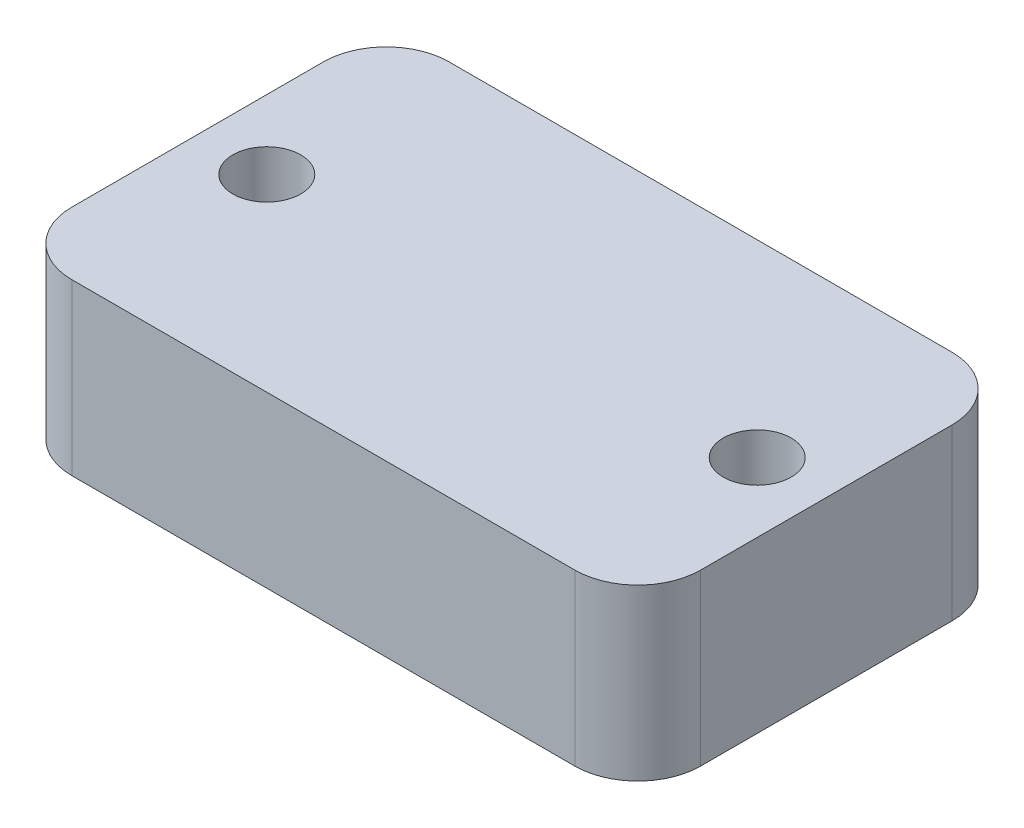
ISO-10303-21;
HEADER;
FILE_DESCRIPTION(('STEP AP214'),'2;1');
FILE_NAME('part.step','',(''),(''),'','','');
FILE_SCHEMA(('AUTOMOTIVE_DESIGN { 1 0 10303 214 1 1 1 1 }'));
ENDSEC;
DATA;
#1=APPLICATION_CONTEXT('core data for automotive mechanical design processes');
#2=APPLICATION_PROTOCOL_DEFINITION('international standard','automotive_design',2000,#1);
#3=PRODUCT_CONTEXT('',#1,'mechanical');
#4=PRODUCT('Part','Part','',(#3));
#5=PRODUCT_RELATED_PRODUCT_CATEGORY('part','',(#4));
#6=PRODUCT_DEFINITION_FORMATION('','',#4);
#7=PRODUCT_DEFINITION_CONTEXT('part definition',#1,'design');
#8=PRODUCT_DEFINITION('design','',#6,#7);
#9=PRODUCT_DEFINITION_SHAPE('','',#8);
#10=(LENGTH_UNIT() NAMED_UNIT(*) SI_UNIT(.MILLI.,.METRE.));
#11=(NAMED_UNIT(*) PLANE_ANGLE_UNIT() SI_UNIT($,.RADIAN.));
#12=(NAMED_UNIT(*) SI_UNIT($,.STERADIAN.) SOLID_ANGLE_UNIT());
#13=UNCERTAINTY_MEASURE_WITH_UNIT(LENGTH_MEASURE(1.E-05),#10,'distance_accuracy_value','');
#14=(GEOMETRIC_REPRESENTATION_CONTEXT(3) GLOBAL_UNCERTAINTY_ASSIGNED_CONTEXT((#13)) GLOBAL_UNIT_ASSIGNED_CONTEXT((#10,
#11,#12)) REPRESENTATION_CONTEXT('',''));
#15=CARTESIAN_POINT('',(0.,0.,0.));
#16=DIRECTION('',(0.,0.,1.));
#17=DIRECTION('',(1.,0.,0.));
#18=AXIS2_PLACEMENT_3D('',#15,#16,#17);
#19=CARTESIAN_POINT('',(20.,13.5,10.));
#20=DIRECTION('',(0.,1.,0.));
#21=DIRECTION('',(0.,0.,1.));
#22=AXIS2_PLACEMENT_3D('',#19,#20,#21);
#23=PLANE('',#22);
#24=CARTESIAN_POINT('',(-19.5,13.5,0.));
#25=DIRECTION('',(0.,1.,0.));
#26=DIRECTION('',(0.,0.,1.));
#27=AXIS2_PLACEMENT_3D('',#24,#25,#26);
#28=CIRCLE('',#27,2.7);
#29=CARTESIAN_POINT('',(-19.5,13.5,2.7));
#30=VERTEX_POINT('',#29);
#31=EDGE_CURVE('E134',#30,#30,#28,.T.);
#32=ORIENTED_EDGE('',*,*,#31,.F.);
#33=EDGE_LOOP('',(#32));
#34=FACE_BOUND('',#33,.T.);
#35=CARTESIAN_POINT('',(20.,13.5,10.));
#36=DIRECTION('',(0.,1.,0.));
#37=DIRECTION('',(0.,0.,1.));
#38=AXIS2_PLACEMENT_3D('',#35,#36,#37);
#39=CIRCLE('',#38,5.);
#40=CARTESIAN_POINT('',(20.,13.5,15.));
#41=VERTEX_POINT('',#40);
#42=CARTESIAN_POINT('',(25.,13.5,9.99999999999996));
#43=VERTEX_POINT('',#42);
#44=EDGE_CURVE('E145',#41,#43,#39,.T.);
#45=ORIENTED_EDGE('',*,*,#44,.T.);
#46=DIRECTION('',(0.,0.,-1.));
#47=VECTOR('',#46,1.);
#48=CARTESIAN_POINT('',(25.,13.5,9.99999999999996));
#49=LINE('',#48,#47);
#50=CARTESIAN_POINT('',(25.,13.5,-9.99999999999997));
#51=VERTEX_POINT('',#50);
#52=EDGE_CURVE('E93',#43,#51,#49,.T.);
#53=ORIENTED_EDGE('',*,*,#52,.T.);
#54=CARTESIAN_POINT('',(20.,13.5,-10.));
#55=DIRECTION('',(0.,1.,0.));
#56=DIRECTION('',(0.,0.,1.));
#57=AXIS2_PLACEMENT_3D('',#54,#55,#56);
#58=CIRCLE('',#57,5.);
#59=CARTESIAN_POINT('',(20.,13.5,-15.));
#60=VERTEX_POINT('',#59);
#61=EDGE_CURVE('E160',#51,#60,#58,.T.);
#62=ORIENTED_EDGE('',*,*,#61,.T.);
#63=DIRECTION('',(-1.,0.,0.));
#64=VECTOR('',#63,1.);
#65=CARTESIAN_POINT('',(20.,13.5,-15.));
#66=LINE('',#65,#64);
#67=CARTESIAN_POINT('',(-20.,13.5,-15.));
#68=VERTEX_POINT('',#67);
#69=EDGE_CURVE('E173',#60,#68,#66,.T.);
#70=ORIENTED_EDGE('',*,*,#69,.T.);
#71=CARTESIAN_POINT('',(-20.,13.5,-9.99999999999999));
#72=DIRECTION('',(0.,1.,0.));
#73=DIRECTION('',(0.,0.,1.));
#74=AXIS2_PLACEMENT_3D('',#71,#72,#73);
#75=CIRCLE('',#74,5.);
#76=CARTESIAN_POINT('',(-25.,13.5,-9.99999999999996));
#77=VERTEX_POINT('',#76);
#78=EDGE_CURVE('E112',#68,#77,#75,.T.);
#79=ORIENTED_EDGE('',*,*,#78,.T.);
#80=DIRECTION('',(0.,0.,1.));
#81=VECTOR('',#80,1.);
#82=CARTESIAN_POINT('',(-25.,13.5,9.99999999999997));
#83=LINE('',#82,#81);
#84=CARTESIAN_POINT('',(-25.,13.5,9.99999999999997));
#85=VERTEX_POINT('',#84);
#86=EDGE_CURVE('E106',#77,#85,#83,.T.);
#87=ORIENTED_EDGE('',*,*,#86,.T.);
#88=CARTESIAN_POINT('',(-20.,13.5,10.));
#89=DIRECTION('',(0.,1.,0.));
#90=DIRECTION('',(0.,0.,-1.));
#91=AXIS2_PLACEMENT_3D('',#88,#89,#90);
#92=CIRCLE('',#91,5.);
#93=CARTESIAN_POINT('',(-20.,13.5,15.));
#94=VERTEX_POINT('',#93);
#95=EDGE_CURVE('E110',#85,#94,#92,.T.);
#96=ORIENTED_EDGE('',*,*,#95,.T.);
#97=DIRECTION('',(1.,0.,0.));
#98=VECTOR('',#97,1.);
#99=CARTESIAN_POINT('',(20.,13.5,15.));
#100=LINE('',#99,#98);
#101=EDGE_CURVE('E50',#94,#41,#100,.T.);
#102=ORIENTED_EDGE('',*,*,#101,.T.);
#103=EDGE_LOOP('',(#45,#53,#62,#70,#79,#87,#96,#102));
#104=FACE_BOUND('',#103,.T.);
#105=CARTESIAN_POINT('',(19.5,13.5,0.));
#106=DIRECTION('',(0.,1.,0.));
#107=DIRECTION('',(0.,0.,-1.));
#108=AXIS2_PLACEMENT_3D('',#105,#106,#107);
#109=CIRCLE('',#108,2.7);
#110=CARTESIAN_POINT('',(19.5,13.5,-2.7));
#111=VERTEX_POINT('',#110);
#112=EDGE_CURVE('E182',#111,#111,#109,.T.);
#113=ORIENTED_EDGE('',*,*,#112,.F.);
#114=EDGE_LOOP('',(#113));
#115=FACE_BOUND('',#114,.T.);
#116=ADVANCED_FACE('F33',(#34,#104,#115),#23,.T.);
#117=CARTESIAN_POINT('',(20.,0.,10.));
#118=DIRECTION('',(0.,1.,0.));
#119=DIRECTION('',(0.,0.,1.));
#120=AXIS2_PLACEMENT_3D('',#117,#118,#119);
#121=PLANE('',#120);
#122=CARTESIAN_POINT('',(20.,0.,10.));
#123=DIRECTION('',(0.,1.,0.));
#124=DIRECTION('',(0.,0.,1.));
#125=AXIS2_PLACEMENT_3D('',#122,#123,#124);
#126=CIRCLE('',#125,5.);
#127=CARTESIAN_POINT('',(20.,0.,15.));
#128=VERTEX_POINT('',#127);
#129=CARTESIAN_POINT('',(25.,0.,9.99999999999996));
#130=VERTEX_POINT('',#129);
#131=EDGE_CURVE('E130',#128,#130,#126,.T.);
#132=ORIENTED_EDGE('',*,*,#131,.F.);
#133=DIRECTION('',(1.,0.,0.));
#134=VECTOR('',#133,1.);
#135=CARTESIAN_POINT('',(20.,0.,15.));
#136=LINE('',#135,#134);
#137=CARTESIAN_POINT('',(-20.,0.,15.));
#138=VERTEX_POINT('',#137);
#139=EDGE_CURVE('E85',#138,#128,#136,.T.);
#140=ORIENTED_EDGE('',*,*,#139,.F.);
#141=CARTESIAN_POINT('',(-20.,0.,10.));
#142=DIRECTION('',(0.,1.,0.));
#143=DIRECTION('',(0.,0.,-1.));
#144=AXIS2_PLACEMENT_3D('',#141,#142,#143);
#145=CIRCLE('',#144,5.);
#146=CARTESIAN_POINT('',(-25.,0.,9.99999999999997));
#147=VERTEX_POINT('',#146);
#148=EDGE_CURVE('E79',#147,#138,#145,.T.);
#149=ORIENTED_EDGE('',*,*,#148,.F.);
#150=DIRECTION('',(0.,0.,1.));
#151=VECTOR('',#150,1.);
#152=CARTESIAN_POINT('',(-25.,0.,9.99999999999997));
#153=LINE('',#152,#151);
#154=CARTESIAN_POINT('',(-25.,0.,-9.99999999999996));
#155=VERTEX_POINT('',#154);
#156=EDGE_CURVE('E120',#155,#147,#153,.T.);
#157=ORIENTED_EDGE('',*,*,#156,.F.);
#158=CARTESIAN_POINT('',(-20.,0.,-9.99999999999999));
#159=DIRECTION('',(0.,1.,0.));
#160=DIRECTION('',(0.,0.,1.));
#161=AXIS2_PLACEMENT_3D('',#158,#159,#160);
#162=CIRCLE('',#161,5.);
#163=CARTESIAN_POINT('',(-20.,0.,-15.));
#164=VERTEX_POINT('',#163);
#165=EDGE_CURVE('E140',#164,#155,#162,.T.);
#166=ORIENTED_EDGE('',*,*,#165,.F.);
#167=DIRECTION('',(-1.,0.,0.));
#168=VECTOR('',#167,1.);
#169=CARTESIAN_POINT('',(20.,0.,-15.));
#170=LINE('',#169,#168);
#171=CARTESIAN_POINT('',(20.,0.,-15.));
#172=VERTEX_POINT('',#171);
#173=EDGE_CURVE('E138',#172,#164,#170,.T.);
#174=ORIENTED_EDGE('',*,*,#173,.F.);
#175=CARTESIAN_POINT('',(20.,0.,-10.));
#176=DIRECTION('',(0.,1.,0.));
#177=DIRECTION('',(0.,0.,1.));
#178=AXIS2_PLACEMENT_3D('',#175,#176,#177);
#179=CIRCLE('',#178,5.);
#180=CARTESIAN_POINT('',(25.,0.,-9.99999999999997));
#181=VERTEX_POINT('',#180);
#182=EDGE_CURVE('E136',#181,#172,#179,.T.);
#183=ORIENTED_EDGE('',*,*,#182,.F.);
#184=DIRECTION('',(0.,0.,-1.));
#185=VECTOR('',#184,1.);
#186=CARTESIAN_POINT('',(25.,0.,9.99999999999996));
#187=LINE('',#186,#185);
#188=EDGE_CURVE('E133',#130,#181,#187,.T.);
#189=ORIENTED_EDGE('',*,*,#188,.F.);
#190=EDGE_LOOP('',(#132,#140,#149,#157,#166,#174,#183,#189));
#191=FACE_BOUND('',#190,.T.);
#192=CARTESIAN_POINT('',(-19.5,0.,0.));
#193=DIRECTION('',(0.,1.,0.));
#194=DIRECTION('',(0.,0.,1.));
#195=AXIS2_PLACEMENT_3D('',#192,#193,#194);
#196=CIRCLE('',#195,2.7);
#197=CARTESIAN_POINT('',(-19.5,0.,2.7));
#198=VERTEX_POINT('',#197);
#199=EDGE_CURVE('E179',#198,#198,#196,.T.);
#200=ORIENTED_EDGE('',*,*,#199,.T.);
#201=EDGE_LOOP('',(#200));
#202=FACE_BOUND('',#201,.T.);
#203=CARTESIAN_POINT('',(19.5,0.,0.));
#204=DIRECTION('',(0.,1.,0.));
#205=DIRECTION('',(0.,0.,-1.));
#206=AXIS2_PLACEMENT_3D('',#203,#204,#205);
#207=CIRCLE('',#206,2.7);
#208=CARTESIAN_POINT('',(19.5,0.,-2.7));
#209=VERTEX_POINT('',#208);
#210=EDGE_CURVE('E185',#209,#209,#207,.T.);
#211=ORIENTED_EDGE('',*,*,#210,.T.);
#212=EDGE_LOOP('',(#211));
#213=FACE_BOUND('',#212,.T.);
#214=ADVANCED_FACE('F164',(#191,#202,#213),#121,.F.);
#215=CARTESIAN_POINT('',(20.,13.5,10.));
#216=DIRECTION('',(0.,-1.,0.));
#217=DIRECTION('',(0.,0.,-1.));
#218=AXIS2_PLACEMENT_3D('',#215,#216,#217);
#219=CYLINDRICAL_SURFACE('',#218,5.);
#220=ORIENTED_EDGE('',*,*,#131,.T.);
#221=DIRECTION('',(0.,-1.,0.));
#222=VECTOR('',#221,1.);
#223=CARTESIAN_POINT('',(25.,13.5,9.99999999999996));
#224=LINE('',#223,#222);
#225=EDGE_CURVE('E11',#43,#130,#224,.T.);
#226=ORIENTED_EDGE('',*,*,#225,.F.);
#227=ORIENTED_EDGE('',*,*,#44,.F.);
#228=DIRECTION('',(0.,-1.,0.));
#229=VECTOR('',#228,1.);
#230=CARTESIAN_POINT('',(20.,13.5,15.));
#231=LINE('',#230,#229);
#232=EDGE_CURVE('E126',#41,#128,#231,.T.);
#233=ORIENTED_EDGE('',*,*,#232,.T.);
#234=EDGE_LOOP('',(#220,#226,#227,#233));
#235=FACE_BOUND('',#234,.T.);
#236=ADVANCED_FACE('F35',(#235),#219,.T.);
#237=CARTESIAN_POINT('',(25.,13.5,9.99999999999996));
#238=DIRECTION('',(-1.,0.,0.));
#239=DIRECTION('',(0.,0.,1.));
#240=AXIS2_PLACEMENT_3D('',#237,#238,#239);
#241=PLANE('',#240);
#242=ORIENTED_EDGE('',*,*,#188,.T.);
#243=DIRECTION('',(0.,-1.,0.));
#244=VECTOR('',#243,1.);
#245=CARTESIAN_POINT('',(25.,13.5,-9.99999999999997));
#246=LINE('',#245,#244);
#247=EDGE_CURVE('E42',#51,#181,#246,.T.);
#248=ORIENTED_EDGE('',*,*,#247,.F.);
#249=ORIENTED_EDGE('',*,*,#52,.F.);
#250=ORIENTED_EDGE('',*,*,#225,.T.);
#251=EDGE_LOOP('',(#242,#248,#249,#250));
#252=FACE_BOUND('',#251,.T.);
#253=ADVANCED_FACE('F217',(#252),#241,.F.);
#254=CARTESIAN_POINT('',(20.,13.5,-10.));
#255=DIRECTION('',(0.,-1.,0.));
#256=DIRECTION('',(0.,0.,-1.));
#257=AXIS2_PLACEMENT_3D('',#254,#255,#256);
#258=CYLINDRICAL_SURFACE('',#257,5.);
#259=ORIENTED_EDGE('',*,*,#182,.T.);
#260=DIRECTION('',(0.,-1.,0.));
#261=VECTOR('',#260,1.);
#262=CARTESIAN_POINT('',(20.,13.5,-15.));
#263=LINE('',#262,#261);
#264=EDGE_CURVE('E152',#60,#172,#263,.T.);
#265=ORIENTED_EDGE('',*,*,#264,.F.);
#266=ORIENTED_EDGE('',*,*,#61,.F.);
#267=ORIENTED_EDGE('',*,*,#247,.T.);
#268=EDGE_LOOP('',(#259,#265,#266,#267));
#269=FACE_BOUND('',#268,.T.);
#270=ADVANCED_FACE('F158',(#269),#258,.T.);
#271=CARTESIAN_POINT('',(20.,13.5,-15.));
#272=DIRECTION('',(0.,0.,1.));
#273=DIRECTION('',(1.,0.,0.));
#274=AXIS2_PLACEMENT_3D('',#271,#272,#273);
#275=PLANE('',#274);
#276=ORIENTED_EDGE('',*,*,#173,.T.);
#277=DIRECTION('',(0.,-1.,0.));
#278=VECTOR('',#277,1.);
#279=CARTESIAN_POINT('',(-20.,13.5,-15.));
#280=LINE('',#279,#278);
#281=EDGE_CURVE('E149',#68,#164,#280,.T.);
#282=ORIENTED_EDGE('',*,*,#281,.F.);
#283=ORIENTED_EDGE('',*,*,#69,.F.);
#284=ORIENTED_EDGE('',*,*,#264,.T.);
#285=EDGE_LOOP('',(#276,#282,#283,#284));
#286=FACE_BOUND('',#285,.T.);
#287=ADVANCED_FACE('F169',(#286),#275,.F.);
#288=CARTESIAN_POINT('',(-20.,13.5,-9.99999999999999));
#289=DIRECTION('',(0.,-1.,0.));
#290=DIRECTION('',(0.,0.,-1.));
#291=AXIS2_PLACEMENT_3D('',#288,#289,#290);
#292=CYLINDRICAL_SURFACE('',#291,5.);
#293=ORIENTED_EDGE('',*,*,#165,.T.);
#294=DIRECTION('',(0.,-1.,0.));
#295=VECTOR('',#294,1.);
#296=CARTESIAN_POINT('',(-25.,13.5,-9.99999999999996));
#297=LINE('',#296,#295);
#298=EDGE_CURVE('E121',#77,#155,#297,.T.);
#299=ORIENTED_EDGE('',*,*,#298,.F.);
#300=ORIENTED_EDGE('',*,*,#78,.F.);
#301=ORIENTED_EDGE('',*,*,#281,.T.);
#302=EDGE_LOOP('',(#293,#299,#300,#301));
#303=FACE_BOUND('',#302,.T.);
#304=ADVANCED_FACE('F172',(#303),#292,.T.);
#305=CARTESIAN_POINT('',(-25.,13.5,9.99999999999997));
#306=DIRECTION('',(1.,0.,0.));
#307=DIRECTION('',(0.,0.,-1.));
#308=AXIS2_PLACEMENT_3D('',#305,#306,#307);
#309=PLANE('',#308);
#310=ORIENTED_EDGE('',*,*,#156,.T.);
#311=DIRECTION('',(0.,-1.,0.));
#312=VECTOR('',#311,1.);
#313=CARTESIAN_POINT('',(-25.,13.5,9.99999999999997));
#314=LINE('',#313,#312);
#315=EDGE_CURVE('E117',#85,#147,#314,.T.);
#316=ORIENTED_EDGE('',*,*,#315,.F.);
#317=ORIENTED_EDGE('',*,*,#86,.F.);
#318=ORIENTED_EDGE('',*,*,#298,.T.);
#319=EDGE_LOOP('',(#310,#316,#317,#318));
#320=FACE_BOUND('',#319,.T.);
#321=ADVANCED_FACE('F118',(#320),#309,.F.);
#322=CARTESIAN_POINT('',(-20.,13.5,10.));
#323=DIRECTION('',(0.,-1.,0.));
#324=DIRECTION('',(0.,0.,-1.));
#325=AXIS2_PLACEMENT_3D('',#322,#323,#324);
#326=CYLINDRICAL_SURFACE('',#325,5.);
#327=ORIENTED_EDGE('',*,*,#148,.T.);
#328=DIRECTION('',(0.,-1.,0.));
#329=VECTOR('',#328,1.);
#330=CARTESIAN_POINT('',(-20.,13.5,15.));
#331=LINE('',#330,#329);
#332=EDGE_CURVE('E122',#94,#138,#331,.T.);
#333=ORIENTED_EDGE('',*,*,#332,.F.);
#334=ORIENTED_EDGE('',*,*,#95,.F.);
#335=ORIENTED_EDGE('',*,*,#315,.T.);
#336=EDGE_LOOP('',(#327,#333,#334,#335));
#337=FACE_BOUND('',#336,.T.);
#338=ADVANCED_FACE('F124',(#337),#326,.T.);
#339=CARTESIAN_POINT('',(20.,13.5,15.));
#340=DIRECTION('',(0.,0.,-1.));
#341=DIRECTION('',(-1.,0.,0.));
#342=AXIS2_PLACEMENT_3D('',#339,#340,#341);
#343=PLANE('',#342);
#344=ORIENTED_EDGE('',*,*,#139,.T.);
#345=ORIENTED_EDGE('',*,*,#232,.F.);
#346=ORIENTED_EDGE('',*,*,#101,.F.);
#347=ORIENTED_EDGE('',*,*,#332,.T.);
#348=EDGE_LOOP('',(#344,#345,#346,#347));
#349=FACE_BOUND('',#348,.T.);
#350=ADVANCED_FACE('F205',(#349),#343,.F.);
#351=CARTESIAN_POINT('',(-19.5,13.5,0.));
#352=DIRECTION('',(0.,-1.,0.));
#353=DIRECTION('',(0.,0.,-1.));
#354=AXIS2_PLACEMENT_3D('',#351,#352,#353);
#355=CYLINDRICAL_SURFACE('',#354,2.7);
#356=ORIENTED_EDGE('',*,*,#31,.T.);
#357=EDGE_LOOP('',(#356));
#358=FACE_BOUND('',#357,.T.);
#359=ORIENTED_EDGE('',*,*,#199,.F.);
#360=EDGE_LOOP('',(#359));
#361=FACE_BOUND('',#360,.T.);
#362=ADVANCED_FACE('F202',(#358,#361),#355,.F.);
#363=CARTESIAN_POINT('',(19.5,13.5,0.));
#364=DIRECTION('',(0.,-1.,0.));
#365=DIRECTION('',(0.,0.,-1.));
#366=AXIS2_PLACEMENT_3D('',#363,#364,#365);
#367=CYLINDRICAL_SURFACE('',#366,2.7);
#368=ORIENTED_EDGE('',*,*,#112,.T.);
#369=EDGE_LOOP('',(#368));
#370=FACE_BOUND('',#369,.T.);
#371=ORIENTED_EDGE('',*,*,#210,.F.);
#372=EDGE_LOOP('',(#371));
#373=FACE_BOUND('',#372,.T.);
#374=ADVANCED_FACE('F191',(#370,#373),#367,.F.);
#375=CLOSED_SHELL('',(#116,#214,#236,#253,#270,#287,#304,#321,#338,#350,#362,#374));
#376=MANIFOLD_SOLID_BREP('B2',#375);
#377=ADVANCED_BREP_SHAPE_REPRESENTATION('',(#18,#376),#14);
#378=SHAPE_DEFINITION_REPRESENTATION(#9,#377);
ENDSEC;
END-ISO-10303-21;
